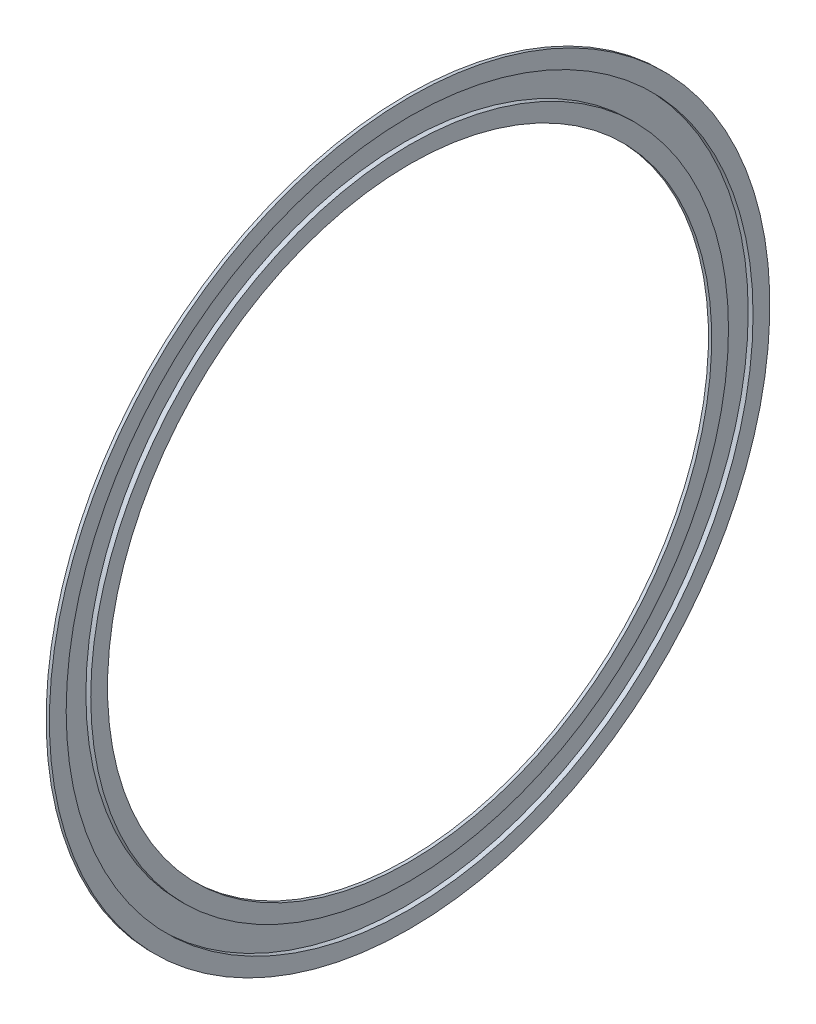
ISO-10303-21;
HEADER;
FILE_DESCRIPTION(('STEP AP214'),'2;1');
FILE_NAME('part.step','',(''),(''),'','','');
FILE_SCHEMA(('AUTOMOTIVE_DESIGN { 1 0 10303 214 1 1 1 1 }'));
ENDSEC;
DATA;
#1=APPLICATION_CONTEXT('core data for automotive mechanical design processes');
#2=APPLICATION_PROTOCOL_DEFINITION('international standard','automotive_design',2000,#1);
#3=PRODUCT_CONTEXT('',#1,'mechanical');
#4=PRODUCT('Part','Part','',(#3));
#5=PRODUCT_RELATED_PRODUCT_CATEGORY('part','',(#4));
#6=PRODUCT_DEFINITION_FORMATION('','',#4);
#7=PRODUCT_DEFINITION_CONTEXT('part definition',#1,'design');
#8=PRODUCT_DEFINITION('design','',#6,#7);
#9=PRODUCT_DEFINITION_SHAPE('','',#8);
#10=(LENGTH_UNIT() NAMED_UNIT(*) SI_UNIT(.MILLI.,.METRE.));
#11=(NAMED_UNIT(*) PLANE_ANGLE_UNIT() SI_UNIT($,.RADIAN.));
#12=(NAMED_UNIT(*) SI_UNIT($,.STERADIAN.) SOLID_ANGLE_UNIT());
#13=UNCERTAINTY_MEASURE_WITH_UNIT(LENGTH_MEASURE(1.E-05),#10,'distance_accuracy_value','');
#14=(GEOMETRIC_REPRESENTATION_CONTEXT(3) GLOBAL_UNCERTAINTY_ASSIGNED_CONTEXT((#13)) GLOBAL_UNIT_ASSIGNED_CONTEXT((#10,
#11,#12)) REPRESENTATION_CONTEXT('',''));
#15=CARTESIAN_POINT('',(0.,0.,0.));
#16=DIRECTION('',(0.,0.,1.));
#17=DIRECTION('',(1.,0.,0.));
#18=AXIS2_PLACEMENT_3D('',#15,#16,#17);
#19=CARTESIAN_POINT('',(-3.,21.78,0.));
#20=DIRECTION('',(1.,0.,0.));
#21=DIRECTION('',(0.,1.,0.));
#22=AXIS2_PLACEMENT_3D('',#19,#20,#21);
#23=PLANE('',#22);
#24=CARTESIAN_POINT('',(-3.,0.,0.));
#25=DIRECTION('',(1.,0.,0.));
#26=DIRECTION('',(0.,1.,0.));
#27=AXIS2_PLACEMENT_3D('',#24,#25,#26);
#28=CIRCLE('',#27,22.3);
#29=CARTESIAN_POINT('',(-3.,22.3,0.));
#30=VERTEX_POINT('',#29);
#31=EDGE_CURVE('E11',#30,#30,#28,.T.);
#32=ORIENTED_EDGE('',*,*,#31,.T.);
#33=EDGE_LOOP('',(#32));
#34=FACE_BOUND('',#33,.T.);
#35=CARTESIAN_POINT('',(-3.,0.,0.));
#36=DIRECTION('',(1.,0.,0.));
#37=DIRECTION('',(0.,1.,0.));
#38=AXIS2_PLACEMENT_3D('',#35,#36,#37);
#39=CIRCLE('',#38,21.26);
#40=CARTESIAN_POINT('',(-3.,21.26,0.));
#41=VERTEX_POINT('',#40);
#42=EDGE_CURVE('E82',#41,#41,#39,.T.);
#43=ORIENTED_EDGE('',*,*,#42,.F.);
#44=EDGE_LOOP('',(#43));
#45=FACE_BOUND('',#44,.T.);
#46=ADVANCED_FACE('F16',(#34,#45),#23,.T.);
#47=CARTESIAN_POINT('',(-3.1,0.,0.));
#48=DIRECTION('',(-1.,0.,0.));
#49=DIRECTION('',(0.,1.,0.));
#50=AXIS2_PLACEMENT_3D('',#47,#48,#49);
#51=CYLINDRICAL_SURFACE('',#50,22.3);
#52=CARTESIAN_POINT('',(-3.2,0.,0.));
#53=DIRECTION('',(1.,0.,0.));
#54=DIRECTION('',(0.,1.,0.));
#55=AXIS2_PLACEMENT_3D('',#52,#53,#54);
#56=CIRCLE('',#55,22.3);
#57=CARTESIAN_POINT('',(-3.2,22.3,0.));
#58=VERTEX_POINT('',#57);
#59=EDGE_CURVE('E26',#58,#58,#56,.T.);
#60=ORIENTED_EDGE('',*,*,#59,.T.);
#61=EDGE_LOOP('',(#60));
#62=FACE_BOUND('',#61,.T.);
#63=ORIENTED_EDGE('',*,*,#31,.F.);
#64=EDGE_LOOP('',(#63));
#65=FACE_BOUND('',#64,.T.);
#66=ADVANCED_FACE('F109',(#62,#65),#51,.T.);
#67=CARTESIAN_POINT('',(-3.2,21.88,0.));
#68=DIRECTION('',(-1.,0.,0.));
#69=DIRECTION('',(0.,-1.,0.));
#70=AXIS2_PLACEMENT_3D('',#67,#68,#69);
#71=PLANE('',#70);
#72=CARTESIAN_POINT('',(-3.2,0.,0.));
#73=DIRECTION('',(1.,0.,0.));
#74=DIRECTION('',(0.,1.,0.));
#75=AXIS2_PLACEMENT_3D('',#72,#73,#74);
#76=CIRCLE('',#75,21.46);
#77=CARTESIAN_POINT('',(-3.2,21.46,0.));
#78=VERTEX_POINT('',#77);
#79=EDGE_CURVE('E71',#78,#78,#76,.T.);
#80=ORIENTED_EDGE('',*,*,#79,.T.);
#81=EDGE_LOOP('',(#80));
#82=FACE_BOUND('',#81,.T.);
#83=ORIENTED_EDGE('',*,*,#59,.F.);
#84=EDGE_LOOP('',(#83));
#85=FACE_BOUND('',#84,.T.);
#86=ADVANCED_FACE('F72',(#82,#85),#71,.T.);
#87=CARTESIAN_POINT('',(-3.35,0.,0.));
#88=DIRECTION('',(-1.,0.,0.));
#89=DIRECTION('',(0.,1.,0.));
#90=AXIS2_PLACEMENT_3D('',#87,#88,#89);
#91=CYLINDRICAL_SURFACE('',#90,21.46);
#92=CARTESIAN_POINT('',(-3.5,0.,0.));
#93=DIRECTION('',(1.,0.,0.));
#94=DIRECTION('',(0.,1.,0.));
#95=AXIS2_PLACEMENT_3D('',#92,#93,#94);
#96=CIRCLE('',#95,21.46);
#97=CARTESIAN_POINT('',(-3.5,21.46,0.));
#98=VERTEX_POINT('',#97);
#99=EDGE_CURVE('E75',#98,#98,#96,.T.);
#100=ORIENTED_EDGE('',*,*,#99,.T.);
#101=EDGE_LOOP('',(#100));
#102=FACE_BOUND('',#101,.T.);
#103=ORIENTED_EDGE('',*,*,#79,.F.);
#104=EDGE_LOOP('',(#103));
#105=FACE_BOUND('',#104,.T.);
#106=ADVANCED_FACE('F125',(#102,#105),#91,.T.);
#107=CARTESIAN_POINT('',(-3.5,20.5,0.));
#108=DIRECTION('',(-1.,0.,0.));
#109=DIRECTION('',(0.,-1.,0.));
#110=AXIS2_PLACEMENT_3D('',#107,#108,#109);
#111=PLANE('',#110);
#112=CARTESIAN_POINT('',(-3.5,0.,0.));
#113=DIRECTION('',(1.,0.,0.));
#114=DIRECTION('',(0.,1.,0.));
#115=AXIS2_PLACEMENT_3D('',#112,#113,#114);
#116=CIRCLE('',#115,19.54);
#117=CARTESIAN_POINT('',(-3.5,19.54,0.));
#118=VERTEX_POINT('',#117);
#119=EDGE_CURVE('E78',#118,#118,#116,.T.);
#120=ORIENTED_EDGE('',*,*,#119,.T.);
#121=EDGE_LOOP('',(#120));
#122=FACE_BOUND('',#121,.T.);
#123=ORIENTED_EDGE('',*,*,#99,.F.);
#124=EDGE_LOOP('',(#123));
#125=FACE_BOUND('',#124,.T.);
#126=ADVANCED_FACE('F122',(#122,#125),#111,.T.);
#127=CARTESIAN_POINT('',(-3.35,0.,0.));
#128=DIRECTION('',(-1.,0.,0.));
#129=DIRECTION('',(0.,1.,0.));
#130=AXIS2_PLACEMENT_3D('',#127,#128,#129);
#131=CYLINDRICAL_SURFACE('',#130,19.54);
#132=CARTESIAN_POINT('',(-3.2,0.,0.));
#133=DIRECTION('',(1.,0.,0.));
#134=DIRECTION('',(0.,1.,0.));
#135=AXIS2_PLACEMENT_3D('',#132,#133,#134);
#136=CIRCLE('',#135,19.54);
#137=CARTESIAN_POINT('',(-3.2,19.54,0.));
#138=VERTEX_POINT('',#137);
#139=EDGE_CURVE('E47',#138,#138,#136,.T.);
#140=ORIENTED_EDGE('',*,*,#139,.T.);
#141=EDGE_LOOP('',(#140));
#142=FACE_BOUND('',#141,.T.);
#143=ORIENTED_EDGE('',*,*,#119,.F.);
#144=EDGE_LOOP('',(#143));
#145=FACE_BOUND('',#144,.T.);
#146=ADVANCED_FACE('F124',(#142,#145),#131,.F.);
#147=CARTESIAN_POINT('',(-3.2,19.12,0.));
#148=DIRECTION('',(-1.,0.,0.));
#149=DIRECTION('',(0.,-1.,0.));
#150=AXIS2_PLACEMENT_3D('',#147,#148,#149);
#151=PLANE('',#150);
#152=CARTESIAN_POINT('',(-3.2,0.,0.));
#153=DIRECTION('',(1.,0.,0.));
#154=DIRECTION('',(0.,1.,0.));
#155=AXIS2_PLACEMENT_3D('',#152,#153,#154);
#156=CIRCLE('',#155,18.7);
#157=CARTESIAN_POINT('',(-3.2,18.7,0.));
#158=VERTEX_POINT('',#157);
#159=EDGE_CURVE('E55',#158,#158,#156,.T.);
#160=ORIENTED_EDGE('',*,*,#159,.T.);
#161=EDGE_LOOP('',(#160));
#162=FACE_BOUND('',#161,.T.);
#163=ORIENTED_EDGE('',*,*,#139,.F.);
#164=EDGE_LOOP('',(#163));
#165=FACE_BOUND('',#164,.T.);
#166=ADVANCED_FACE('F121',(#162,#165),#151,.T.);
#167=CARTESIAN_POINT('',(-3.1,0.,0.));
#168=DIRECTION('',(-1.,0.,0.));
#169=DIRECTION('',(0.,1.,0.));
#170=AXIS2_PLACEMENT_3D('',#167,#168,#169);
#171=CYLINDRICAL_SURFACE('',#170,18.7);
#172=CARTESIAN_POINT('',(-3.,0.,0.));
#173=DIRECTION('',(1.,0.,0.));
#174=DIRECTION('',(0.,1.,0.));
#175=AXIS2_PLACEMENT_3D('',#172,#173,#174);
#176=CIRCLE('',#175,18.7);
#177=CARTESIAN_POINT('',(-3.,18.7,0.));
#178=VERTEX_POINT('',#177);
#179=EDGE_CURVE('E60',#178,#178,#176,.T.);
#180=ORIENTED_EDGE('',*,*,#179,.T.);
#181=EDGE_LOOP('',(#180));
#182=FACE_BOUND('',#181,.T.);
#183=ORIENTED_EDGE('',*,*,#159,.F.);
#184=EDGE_LOOP('',(#183));
#185=FACE_BOUND('',#184,.T.);
#186=ADVANCED_FACE('F106',(#182,#185),#171,.F.);
#187=CARTESIAN_POINT('',(-3.,19.22,0.));
#188=DIRECTION('',(1.,0.,0.));
#189=DIRECTION('',(0.,1.,0.));
#190=AXIS2_PLACEMENT_3D('',#187,#188,#189);
#191=PLANE('',#190);
#192=CARTESIAN_POINT('',(-3.,0.,0.));
#193=DIRECTION('',(1.,0.,0.));
#194=DIRECTION('',(0.,1.,0.));
#195=AXIS2_PLACEMENT_3D('',#192,#193,#194);
#196=CIRCLE('',#195,19.74);
#197=CARTESIAN_POINT('',(-3.,19.74,0.));
#198=VERTEX_POINT('',#197);
#199=EDGE_CURVE('E20',#198,#198,#196,.T.);
#200=ORIENTED_EDGE('',*,*,#199,.T.);
#201=EDGE_LOOP('',(#200));
#202=FACE_BOUND('',#201,.T.);
#203=ORIENTED_EDGE('',*,*,#179,.F.);
#204=EDGE_LOOP('',(#203));
#205=FACE_BOUND('',#204,.T.);
#206=ADVANCED_FACE('F92',(#202,#205),#191,.T.);
#207=CARTESIAN_POINT('',(-3.15,0.,0.));
#208=DIRECTION('',(-1.,0.,0.));
#209=DIRECTION('',(0.,1.,0.));
#210=AXIS2_PLACEMENT_3D('',#207,#208,#209);
#211=CYLINDRICAL_SURFACE('',#210,19.74);
#212=CARTESIAN_POINT('',(-3.3,0.,0.));
#213=DIRECTION('',(1.,0.,0.));
#214=DIRECTION('',(0.,1.,0.));
#215=AXIS2_PLACEMENT_3D('',#212,#213,#214);
#216=CIRCLE('',#215,19.74);
#217=CARTESIAN_POINT('',(-3.3,19.74,0.));
#218=VERTEX_POINT('',#217);
#219=EDGE_CURVE('E86',#218,#218,#216,.T.);
#220=ORIENTED_EDGE('',*,*,#219,.T.);
#221=EDGE_LOOP('',(#220));
#222=FACE_BOUND('',#221,.T.);
#223=ORIENTED_EDGE('',*,*,#199,.F.);
#224=EDGE_LOOP('',(#223));
#225=FACE_BOUND('',#224,.T.);
#226=ADVANCED_FACE('F18',(#222,#225),#211,.T.);
#227=CARTESIAN_POINT('',(-3.3,20.5,0.));
#228=DIRECTION('',(1.,0.,0.));
#229=DIRECTION('',(0.,1.,0.));
#230=AXIS2_PLACEMENT_3D('',#227,#228,#229);
#231=PLANE('',#230);
#232=CARTESIAN_POINT('',(-3.3,0.,0.));
#233=DIRECTION('',(1.,0.,0.));
#234=DIRECTION('',(0.,1.,0.));
#235=AXIS2_PLACEMENT_3D('',#232,#233,#234);
#236=CIRCLE('',#235,21.26);
#237=CARTESIAN_POINT('',(-3.3,21.26,0.));
#238=VERTEX_POINT('',#237);
#239=EDGE_CURVE('E81',#238,#238,#236,.T.);
#240=ORIENTED_EDGE('',*,*,#239,.T.);
#241=EDGE_LOOP('',(#240));
#242=FACE_BOUND('',#241,.T.);
#243=ORIENTED_EDGE('',*,*,#219,.F.);
#244=EDGE_LOOP('',(#243));
#245=FACE_BOUND('',#244,.T.);
#246=ADVANCED_FACE('F96',(#242,#245),#231,.T.);
#247=CARTESIAN_POINT('',(-3.15,0.,0.));
#248=DIRECTION('',(-1.,0.,0.));
#249=DIRECTION('',(0.,1.,0.));
#250=AXIS2_PLACEMENT_3D('',#247,#248,#249);
#251=CYLINDRICAL_SURFACE('',#250,21.26);
#252=ORIENTED_EDGE('',*,*,#42,.T.);
#253=EDGE_LOOP('',(#252));
#254=FACE_BOUND('',#253,.T.);
#255=ORIENTED_EDGE('',*,*,#239,.F.);
#256=EDGE_LOOP('',(#255));
#257=FACE_BOUND('',#256,.T.);
#258=ADVANCED_FACE('F103',(#254,#257),#251,.F.);
#259=CLOSED_SHELL('',(#46,#66,#86,#106,#126,#146,#166,#186,#206,#226,#246,#258));
#260=MANIFOLD_SOLID_BREP('B1',#259);
#261=ADVANCED_BREP_SHAPE_REPRESENTATION('',(#18,#260),#14);
#262=SHAPE_DEFINITION_REPRESENTATION(#9,#261);
ENDSEC;
END-ISO-10303-21;
